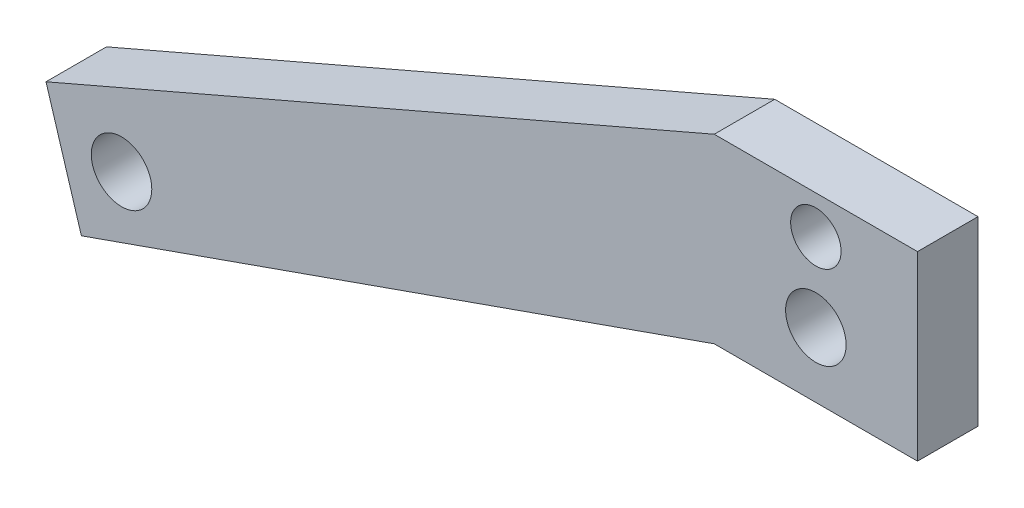
ISO-10303-21;
HEADER;
FILE_DESCRIPTION(('STEP AP214'),'2;1');
FILE_NAME('part.step','',(''),(''),'','','');
FILE_SCHEMA(('AUTOMOTIVE_DESIGN { 1 0 10303 214 1 1 1 1 }'));
ENDSEC;
DATA;
#1=APPLICATION_CONTEXT('core data for automotive mechanical design processes');
#2=APPLICATION_PROTOCOL_DEFINITION('international standard','automotive_design',2000,#1);
#3=PRODUCT_CONTEXT('',#1,'mechanical');
#4=PRODUCT('Part','Part','',(#3));
#5=PRODUCT_RELATED_PRODUCT_CATEGORY('part','',(#4));
#6=PRODUCT_DEFINITION_FORMATION('','',#4);
#7=PRODUCT_DEFINITION_CONTEXT('part definition',#1,'design');
#8=PRODUCT_DEFINITION('design','',#6,#7);
#9=PRODUCT_DEFINITION_SHAPE('','',#8);
#10=(LENGTH_UNIT() NAMED_UNIT(*) SI_UNIT(.MILLI.,.METRE.));
#11=(NAMED_UNIT(*) PLANE_ANGLE_UNIT() SI_UNIT($,.RADIAN.));
#12=(NAMED_UNIT(*) SI_UNIT($,.STERADIAN.) SOLID_ANGLE_UNIT());
#13=UNCERTAINTY_MEASURE_WITH_UNIT(LENGTH_MEASURE(1.E-05),#10,'distance_accuracy_value','');
#14=(GEOMETRIC_REPRESENTATION_CONTEXT(3) GLOBAL_UNCERTAINTY_ASSIGNED_CONTEXT((#13)) GLOBAL_UNIT_ASSIGNED_CONTEXT((#10,
#11,#12)) REPRESENTATION_CONTEXT('',''));
#15=CARTESIAN_POINT('',(0.,0.,0.));
#16=DIRECTION('',(0.,0.,1.));
#17=DIRECTION('',(1.,0.,0.));
#18=AXIS2_PLACEMENT_3D('',#15,#16,#17);
#19=CARTESIAN_POINT('',(-110.963863392355,-33.9250575722306,9.525));
#20=DIRECTION('',(-0.956304755963035,-0.292371704722739,0.));
#21=DIRECTION('',(0.292371704722739,-0.956304755963035,0.));
#22=AXIS2_PLACEMENT_3D('',#19,#20,#21);
#23=PLANE('',#22);
#24=DIRECTION('',(-0.292371704722739,0.956304755963035,0.));
#25=VECTOR('',#24,1.);
#26=CARTESIAN_POINT('',(-110.963863392355,-33.9250575722306,0.));
#27=LINE('',#26,#25);
#28=CARTESIAN_POINT('',(-115.62958968061,-18.6641545251605,0.));
#29=VERTEX_POINT('',#28);
#30=CARTESIAN_POINT('',(-121.199270655579,-0.44654892406467,0.));
#31=VERTEX_POINT('',#30);
#32=EDGE_CURVE('E134',#29,#31,#27,.T.);
#33=ORIENTED_EDGE('',*,*,#32,.F.);
#34=DIRECTION('',(0.,0.,-1.));
#35=VECTOR('',#34,1.);
#36=CARTESIAN_POINT('',(-115.62958968061,-18.6641545251605,9.525));
#37=LINE('',#36,#35);
#38=CARTESIAN_POINT('',(-115.62958968061,-18.6641545251605,9.525));
#39=VERTEX_POINT('',#38);
#40=EDGE_CURVE('E11',#39,#29,#37,.T.);
#41=ORIENTED_EDGE('',*,*,#40,.F.);
#42=DIRECTION('',(-0.292371704722739,0.956304755963035,0.));
#43=VECTOR('',#42,1.);
#44=CARTESIAN_POINT('',(-110.963863392355,-33.9250575722306,9.525));
#45=LINE('',#44,#43);
#46=CARTESIAN_POINT('',(-121.199270655579,-0.44654892406467,9.525));
#47=VERTEX_POINT('',#46);
#48=EDGE_CURVE('E258',#39,#47,#45,.T.);
#49=ORIENTED_EDGE('',*,*,#48,.T.);
#50=DIRECTION('',(0.,0.,-1.));
#51=VECTOR('',#50,1.);
#52=CARTESIAN_POINT('',(-121.199270655579,-0.44654892406467,9.525));
#53=LINE('',#52,#51);
#54=EDGE_CURVE('E84',#47,#31,#53,.T.);
#55=ORIENTED_EDGE('',*,*,#54,.T.);
#56=EDGE_LOOP('',(#33,#41,#49,#55));
#57=FACE_BOUND('',#56,.T.);
#58=ADVANCED_FACE('F39',(#57),#23,.T.);
#59=CARTESIAN_POINT('',(-6.91209033449553,19.625699628189,9.525));
#60=DIRECTION('',(0.332194931329718,-0.943210754603044,0.));
#61=DIRECTION('',(0.943210754603044,0.332194931329718,0.));
#62=AXIS2_PLACEMENT_3D('',#59,#60,#61);
#63=PLANE('',#62);
#64=DIRECTION('',(-0.943210754603044,-0.332194931329718,0.));
#65=VECTOR('',#64,1.);
#66=CARTESIAN_POINT('',(-6.91209033449553,19.625699628189,0.));
#67=LINE('',#66,#65);
#68=CARTESIAN_POINT('',(-15.9999937728734,16.4249775796861,0.));
#69=VERTEX_POINT('',#68);
#70=EDGE_CURVE('E132',#69,#29,#67,.T.);
#71=ORIENTED_EDGE('',*,*,#70,.F.);
#72=DIRECTION('',(0.,0.,-1.));
#73=VECTOR('',#72,1.);
#74=CARTESIAN_POINT('',(-15.9999937728734,16.4249775796861,9.525));
#75=LINE('',#74,#73);
#76=CARTESIAN_POINT('',(-15.9999937728734,16.4249775796861,9.525));
#77=VERTEX_POINT('',#76);
#78=EDGE_CURVE('E48',#77,#69,#75,.T.);
#79=ORIENTED_EDGE('',*,*,#78,.F.);
#80=DIRECTION('',(-0.943210754603044,-0.332194931329718,0.));
#81=VECTOR('',#80,1.);
#82=CARTESIAN_POINT('',(-6.91209033449553,19.625699628189,9.525));
#83=LINE('',#82,#81);
#84=EDGE_CURVE('E259',#77,#39,#83,.T.);
#85=ORIENTED_EDGE('',*,*,#84,.T.);
#86=ORIENTED_EDGE('',*,*,#40,.T.);
#87=EDGE_LOOP('',(#71,#79,#85,#86));
#88=FACE_BOUND('',#87,.T.);
#89=ADVANCED_FACE('F133',(#88),#63,.T.);
#90=CARTESIAN_POINT('',(0.,16.4249775796861,9.525));
#91=DIRECTION('',(0.,-1.,0.));
#92=DIRECTION('',(1.,0.,0.));
#93=AXIS2_PLACEMENT_3D('',#90,#91,#92);
#94=PLANE('',#93);
#95=DIRECTION('',(-1.,0.,0.));
#96=VECTOR('',#95,1.);
#97=CARTESIAN_POINT('',(0.,16.4249775796861,0.));
#98=LINE('',#97,#96);
#99=CARTESIAN_POINT('',(16.0000062271267,16.4249775796861,0.));
#100=VERTEX_POINT('',#99);
#101=EDGE_CURVE('E128',#100,#69,#98,.T.);
#102=ORIENTED_EDGE('',*,*,#101,.F.);
#103=DIRECTION('',(0.,0.,-1.));
#104=VECTOR('',#103,1.);
#105=CARTESIAN_POINT('',(16.0000062271267,16.4249775796861,9.525));
#106=LINE('',#105,#104);
#107=CARTESIAN_POINT('',(16.0000062271267,16.4249775796861,9.525));
#108=VERTEX_POINT('',#107);
#109=EDGE_CURVE('E118',#108,#100,#106,.T.);
#110=ORIENTED_EDGE('',*,*,#109,.F.);
#111=DIRECTION('',(-1.,0.,0.));
#112=VECTOR('',#111,1.);
#113=CARTESIAN_POINT('',(0.,16.4249775796861,9.525));
#114=LINE('',#113,#112);
#115=EDGE_CURVE('E112',#108,#77,#114,.T.);
#116=ORIENTED_EDGE('',*,*,#115,.T.);
#117=ORIENTED_EDGE('',*,*,#78,.T.);
#118=EDGE_LOOP('',(#102,#110,#116,#117));
#119=FACE_BOUND('',#118,.T.);
#120=ADVANCED_FACE('F126',(#119),#94,.T.);
#121=CARTESIAN_POINT('',(16.0000062271267,0.,9.525));
#122=DIRECTION('',(-1.,0.,0.));
#123=DIRECTION('',(0.,-1.,0.));
#124=AXIS2_PLACEMENT_3D('',#121,#122,#123);
#125=PLANE('',#124);
#126=DIRECTION('',(0.,1.,0.));
#127=VECTOR('',#126,1.);
#128=CARTESIAN_POINT('',(16.0000062271267,0.,0.));
#129=LINE('',#128,#127);
#130=CARTESIAN_POINT('',(16.0000062271267,44.9999775796863,0.));
#131=VERTEX_POINT('',#130);
#132=EDGE_CURVE('E117',#100,#131,#129,.T.);
#133=ORIENTED_EDGE('',*,*,#132,.T.);
#134=DIRECTION('',(0.,0.,-1.));
#135=VECTOR('',#134,1.);
#136=CARTESIAN_POINT('',(16.0000062271267,44.9999775796863,9.525));
#137=LINE('',#136,#135);
#138=CARTESIAN_POINT('',(16.0000062271267,44.9999775796863,9.525));
#139=VERTEX_POINT('',#138);
#140=EDGE_CURVE('E102',#139,#131,#137,.T.);
#141=ORIENTED_EDGE('',*,*,#140,.F.);
#142=DIRECTION('',(0.,1.,0.));
#143=VECTOR('',#142,1.);
#144=CARTESIAN_POINT('',(16.0000062271267,0.,9.525));
#145=LINE('',#144,#143);
#146=EDGE_CURVE('E105',#108,#139,#145,.T.);
#147=ORIENTED_EDGE('',*,*,#146,.F.);
#148=ORIENTED_EDGE('',*,*,#109,.T.);
#149=EDGE_LOOP('',(#133,#141,#147,#148));
#150=FACE_BOUND('',#149,.T.);
#151=ADVANCED_FACE('F115',(#150),#125,.F.);
#152=CARTESIAN_POINT('',(0.,44.9999775796863,9.525));
#153=DIRECTION('',(0.,-1.,0.));
#154=DIRECTION('',(0.,0.,-1.));
#155=AXIS2_PLACEMENT_3D('',#152,#153,#154);
#156=PLANE('',#155);
#157=DIRECTION('',(-1.,0.,0.));
#158=VECTOR('',#157,1.);
#159=CARTESIAN_POINT('',(0.,44.9999775796863,0.));
#160=LINE('',#159,#158);
#161=CARTESIAN_POINT('',(-15.9999937728733,44.9999775796863,0.));
#162=VERTEX_POINT('',#161);
#163=EDGE_CURVE('E138',#131,#162,#160,.T.);
#164=ORIENTED_EDGE('',*,*,#163,.T.);
#165=DIRECTION('',(0.,0.,-1.));
#166=VECTOR('',#165,1.);
#167=CARTESIAN_POINT('',(-15.9999937728733,44.9999775796863,9.525));
#168=LINE('',#167,#166);
#169=CARTESIAN_POINT('',(-15.9999937728733,44.9999775796863,9.525));
#170=VERTEX_POINT('',#169);
#171=EDGE_CURVE('E104',#170,#162,#168,.T.);
#172=ORIENTED_EDGE('',*,*,#171,.F.);
#173=DIRECTION('',(-1.,0.,0.));
#174=VECTOR('',#173,1.);
#175=CARTESIAN_POINT('',(0.,44.9999775796863,9.525));
#176=LINE('',#175,#174);
#177=EDGE_CURVE('E97',#139,#170,#176,.T.);
#178=ORIENTED_EDGE('',*,*,#177,.F.);
#179=ORIENTED_EDGE('',*,*,#140,.T.);
#180=EDGE_LOOP('',(#164,#172,#178,#179));
#181=FACE_BOUND('',#180,.T.);
#182=ADVANCED_FACE('F100',(#181),#156,.F.);
#183=CARTESIAN_POINT('',(6.22712671610374E-06,38.9999775796863,9.525));
#184=DIRECTION('',(0.,0.,-1.));
#185=DIRECTION('',(-1.,0.,0.));
#186=AXIS2_PLACEMENT_3D('',#183,#184,#185);
#187=CYLINDRICAL_SURFACE('',#186,3.96875);
#188=CARTESIAN_POINT('',(6.22712671610374E-06,38.9999775796863,9.525));
#189=DIRECTION('',(0.,0.,1.));
#190=DIRECTION('',(1.,0.,0.));
#191=AXIS2_PLACEMENT_3D('',#188,#189,#190);
#192=CIRCLE('',#191,3.96875);
#193=CARTESIAN_POINT('',(3.96875622712672,38.9999775796863,9.525));
#194=VERTEX_POINT('',#193);
#195=EDGE_CURVE('E260',#194,#194,#192,.T.);
#196=ORIENTED_EDGE('',*,*,#195,.T.);
#197=EDGE_LOOP('',(#196));
#198=FACE_BOUND('',#197,.T.);
#199=CARTESIAN_POINT('',(6.22712671610374E-06,38.9999775796863,0.));
#200=DIRECTION('',(0.,0.,1.));
#201=DIRECTION('',(1.,0.,0.));
#202=AXIS2_PLACEMENT_3D('',#199,#200,#201);
#203=CIRCLE('',#202,3.96875);
#204=CARTESIAN_POINT('',(3.96875622712672,38.9999775796863,0.));
#205=VERTEX_POINT('',#204);
#206=EDGE_CURVE('E152',#205,#205,#203,.T.);
#207=ORIENTED_EDGE('',*,*,#206,.F.);
#208=EDGE_LOOP('',(#207));
#209=FACE_BOUND('',#208,.T.);
#210=ADVANCED_FACE('F162',(#198,#209),#187,.F.);
#211=CARTESIAN_POINT('',(6.23902837032508E-06,26.6475746126805,9.525));
#212=DIRECTION('',(0.,0.,-1.));
#213=DIRECTION('',(-1.,0.,0.));
#214=AXIS2_PLACEMENT_3D('',#211,#212,#213);
#215=CYLINDRICAL_SURFACE('',#214,4.76250000164186);
#216=CARTESIAN_POINT('',(6.23902837032508E-06,26.6475746126805,9.525));
#217=DIRECTION('',(0.,0.,1.));
#218=DIRECTION('',(1.,0.,0.));
#219=AXIS2_PLACEMENT_3D('',#216,#217,#218);
#220=CIRCLE('',#219,4.76250000164186);
#221=CARTESIAN_POINT('',(4.76250624067023,26.6475746126805,9.525));
#222=VERTEX_POINT('',#221);
#223=EDGE_CURVE('E176',#222,#222,#220,.T.);
#224=ORIENTED_EDGE('',*,*,#223,.T.);
#225=EDGE_LOOP('',(#224));
#226=FACE_BOUND('',#225,.T.);
#227=CARTESIAN_POINT('',(6.23902837032508E-06,26.6475746126805,0.));
#228=DIRECTION('',(0.,0.,1.));
#229=DIRECTION('',(1.,0.,0.));
#230=AXIS2_PLACEMENT_3D('',#227,#228,#229);
#231=CIRCLE('',#230,4.76250000164186);
#232=CARTESIAN_POINT('',(4.76250624067023,26.6475746126805,0.));
#233=VERTEX_POINT('',#232);
#234=EDGE_CURVE('E149',#233,#233,#231,.T.);
#235=ORIENTED_EDGE('',*,*,#234,.F.);
#236=EDGE_LOOP('',(#235));
#237=FACE_BOUND('',#236,.T.);
#238=ADVANCED_FACE('F164',(#226,#237),#215,.F.);
#239=CARTESIAN_POINT('',(-109.305627367547,-6.77051123712846,9.525));
#240=DIRECTION('',(0.,0.,-1.));
#241=DIRECTION('',(-1.,0.,0.));
#242=AXIS2_PLACEMENT_3D('',#239,#240,#241);
#243=CYLINDRICAL_SURFACE('',#242,4.76250000164186);
#244=CARTESIAN_POINT('',(-109.305627367547,-6.77051123712846,9.525));
#245=DIRECTION('',(0.,0.,1.));
#246=DIRECTION('',(1.,0.,0.));
#247=AXIS2_PLACEMENT_3D('',#244,#245,#246);
#248=CIRCLE('',#247,4.76250000164186);
#249=CARTESIAN_POINT('',(-104.543127365905,-6.77051123712846,9.525));
#250=VERTEX_POINT('',#249);
#251=EDGE_CURVE('E143',#250,#250,#248,.T.);
#252=ORIENTED_EDGE('',*,*,#251,.T.);
#253=EDGE_LOOP('',(#252));
#254=FACE_BOUND('',#253,.T.);
#255=CARTESIAN_POINT('',(-109.305627367547,-6.77051123712846,0.));
#256=DIRECTION('',(0.,0.,1.));
#257=DIRECTION('',(1.,0.,0.));
#258=AXIS2_PLACEMENT_3D('',#255,#256,#257);
#259=CIRCLE('',#258,4.76250000164186);
#260=CARTESIAN_POINT('',(-104.543127365905,-6.77051123712846,0.));
#261=VERTEX_POINT('',#260);
#262=EDGE_CURVE('E146',#261,#261,#259,.T.);
#263=ORIENTED_EDGE('',*,*,#262,.F.);
#264=EDGE_LOOP('',(#263));
#265=FACE_BOUND('',#264,.T.);
#266=ADVANCED_FACE('F41',(#254,#265),#243,.F.);
#267=CARTESIAN_POINT('',(-18.8991209022775,43.7475425646517,9.525));
#268=DIRECTION('',(0.396579916842988,-0.918000201283643,0.));
#269=DIRECTION('',(0.918000201283643,0.396579916842988,0.));
#270=AXIS2_PLACEMENT_3D('',#267,#268,#269);
#271=PLANE('',#270);
#272=DIRECTION('',(-0.918000201283643,-0.396579916842988,0.));
#273=VECTOR('',#272,1.);
#274=CARTESIAN_POINT('',(-18.8991209022775,43.7475425646517,0.));
#275=LINE('',#274,#273);
#276=EDGE_CURVE('E77',#162,#31,#275,.T.);
#277=ORIENTED_EDGE('',*,*,#276,.T.);
#278=ORIENTED_EDGE('',*,*,#54,.F.);
#279=DIRECTION('',(-0.918000201283643,-0.396579916842988,0.));
#280=VECTOR('',#279,1.);
#281=CARTESIAN_POINT('',(-18.8991209022775,43.7475425646517,9.525));
#282=LINE('',#281,#280);
#283=EDGE_CURVE('E56',#170,#47,#282,.T.);
#284=ORIENTED_EDGE('',*,*,#283,.F.);
#285=ORIENTED_EDGE('',*,*,#171,.T.);
#286=EDGE_LOOP('',(#277,#278,#284,#285));
#287=FACE_BOUND('',#286,.T.);
#288=ADVANCED_FACE('F171',(#287),#271,.F.);
#289=CARTESIAN_POINT('',(0.,0.,9.525));
#290=DIRECTION('',(0.,0.,1.));
#291=DIRECTION('',(1.,0.,0.));
#292=AXIS2_PLACEMENT_3D('',#289,#290,#291);
#293=PLANE('',#292);
#294=ORIENTED_EDGE('',*,*,#251,.F.);
#295=EDGE_LOOP('',(#294));
#296=FACE_BOUND('',#295,.T.);
#297=ORIENTED_EDGE('',*,*,#223,.F.);
#298=EDGE_LOOP('',(#297));
#299=FACE_BOUND('',#298,.T.);
#300=ORIENTED_EDGE('',*,*,#195,.F.);
#301=EDGE_LOOP('',(#300));
#302=FACE_BOUND('',#301,.T.);
#303=ORIENTED_EDGE('',*,*,#48,.F.);
#304=ORIENTED_EDGE('',*,*,#84,.F.);
#305=ORIENTED_EDGE('',*,*,#115,.F.);
#306=ORIENTED_EDGE('',*,*,#146,.T.);
#307=ORIENTED_EDGE('',*,*,#177,.T.);
#308=ORIENTED_EDGE('',*,*,#283,.T.);
#309=EDGE_LOOP('',(#303,#304,#305,#306,#307,#308));
#310=FACE_BOUND('',#309,.T.);
#311=ADVANCED_FACE('F109',(#296,#299,#302,#310),#293,.T.);
#312=CARTESIAN_POINT('',(0.,0.,0.));
#313=DIRECTION('',(0.,0.,1.));
#314=DIRECTION('',(1.,0.,0.));
#315=AXIS2_PLACEMENT_3D('',#312,#313,#314);
#316=PLANE('',#315);
#317=ORIENTED_EDGE('',*,*,#262,.T.);
#318=EDGE_LOOP('',(#317));
#319=FACE_BOUND('',#318,.T.);
#320=ORIENTED_EDGE('',*,*,#234,.T.);
#321=EDGE_LOOP('',(#320));
#322=FACE_BOUND('',#321,.T.);
#323=ORIENTED_EDGE('',*,*,#206,.T.);
#324=EDGE_LOOP('',(#323));
#325=FACE_BOUND('',#324,.T.);
#326=ORIENTED_EDGE('',*,*,#32,.T.);
#327=ORIENTED_EDGE('',*,*,#276,.F.);
#328=ORIENTED_EDGE('',*,*,#163,.F.);
#329=ORIENTED_EDGE('',*,*,#132,.F.);
#330=ORIENTED_EDGE('',*,*,#101,.T.);
#331=ORIENTED_EDGE('',*,*,#70,.T.);
#332=EDGE_LOOP('',(#326,#327,#328,#329,#330,#331));
#333=FACE_BOUND('',#332,.T.);
#334=ADVANCED_FACE('F136',(#319,#322,#325,#333),#316,.F.);
#335=CLOSED_SHELL('',(#58,#89,#120,#151,#182,#210,#238,#266,#288,#311,#334));
#336=MANIFOLD_SOLID_BREP('B2',#335);
#337=ADVANCED_BREP_SHAPE_REPRESENTATION('',(#18,#336),#14);
#338=SHAPE_DEFINITION_REPRESENTATION(#9,#337);
ENDSEC;
END-ISO-10303-21;
